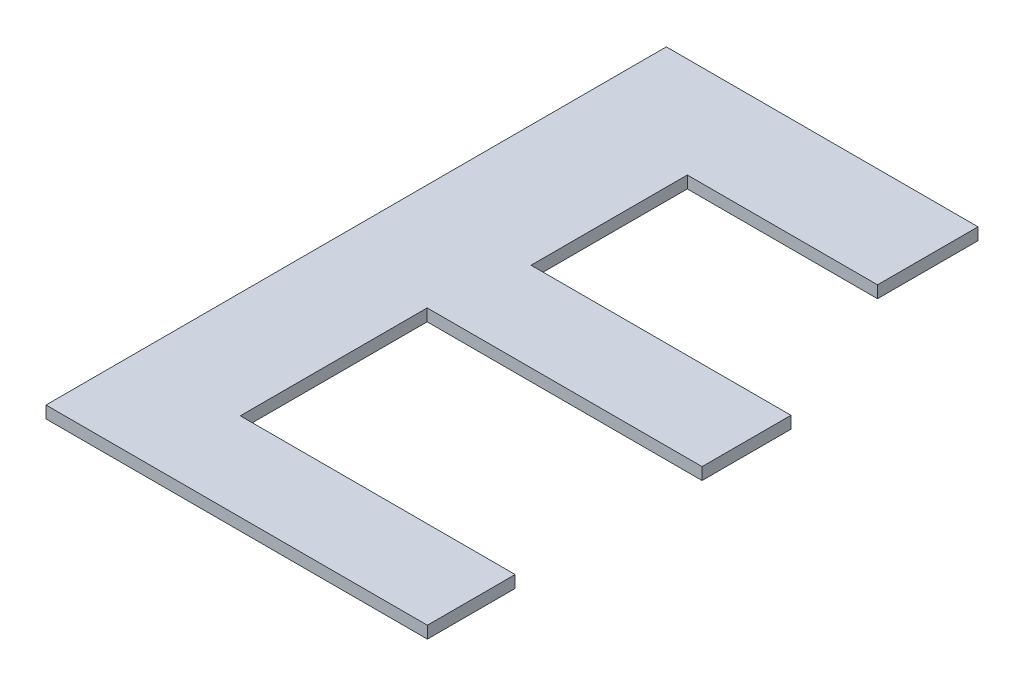
ISO-10303-21;
HEADER;
FILE_DESCRIPTION(('STEP AP214'),'2;1');
FILE_NAME('part.step','',(''),(''),'','','');
FILE_SCHEMA(('AUTOMOTIVE_DESIGN { 1 0 10303 214 1 1 1 1 }'));
ENDSEC;
DATA;
#1=APPLICATION_CONTEXT('core data for automotive mechanical design processes');
#2=APPLICATION_PROTOCOL_DEFINITION('international standard','automotive_design',2000,#1);
#3=PRODUCT_CONTEXT('',#1,'mechanical');
#4=PRODUCT('Part','Part','',(#3));
#5=PRODUCT_RELATED_PRODUCT_CATEGORY('part','',(#4));
#6=PRODUCT_DEFINITION_FORMATION('','',#4);
#7=PRODUCT_DEFINITION_CONTEXT('part definition',#1,'design');
#8=PRODUCT_DEFINITION('design','',#6,#7);
#9=PRODUCT_DEFINITION_SHAPE('','',#8);
#10=(LENGTH_UNIT() NAMED_UNIT(*) SI_UNIT(.MILLI.,.METRE.));
#11=(NAMED_UNIT(*) PLANE_ANGLE_UNIT() SI_UNIT($,.RADIAN.));
#12=(NAMED_UNIT(*) SI_UNIT($,.STERADIAN.) SOLID_ANGLE_UNIT());
#13=UNCERTAINTY_MEASURE_WITH_UNIT(LENGTH_MEASURE(1.E-05),#10,'distance_accuracy_value','');
#14=(GEOMETRIC_REPRESENTATION_CONTEXT(3) GLOBAL_UNCERTAINTY_ASSIGNED_CONTEXT((#13)) GLOBAL_UNIT_ASSIGNED_CONTEXT((#10,
#11,#12)) REPRESENTATION_CONTEXT('',''));
#15=CARTESIAN_POINT('',(0.,0.,0.));
#16=DIRECTION('',(0.,0.,1.));
#17=DIRECTION('',(1.,0.,0.));
#18=AXIS2_PLACEMENT_3D('',#15,#16,#17);
#19=CARTESIAN_POINT('',(-22786.0831141368,6067.85712854681,41050.1414169554));
#20=DIRECTION('',(0.,0.,-1.));
#21=DIRECTION('',(-1.,0.,0.));
#22=AXIS2_PLACEMENT_3D('',#19,#20,#21);
#23=PLANE('',#22);
#24=DIRECTION('',(-1.,0.,0.));
#25=VECTOR('',#24,1.);
#26=CARTESIAN_POINT('',(-22786.0831141368,6087.85712854681,41050.1414169554));
#27=LINE('',#26,#25);
#28=CARTESIAN_POINT('',(-22786.0831141368,6087.85712854681,41050.1414169554));
#29=VERTEX_POINT('',#28);
#30=CARTESIAN_POINT('',(-23417.7710712875,6087.85712854681,41050.1414169554));
#31=VERTEX_POINT('',#30);
#32=EDGE_CURVE('E157',#29,#31,#27,.T.);
#33=ORIENTED_EDGE('',*,*,#32,.T.);
#34=DIRECTION('',(0.,1.,0.));
#35=VECTOR('',#34,1.);
#36=CARTESIAN_POINT('',(-23417.7710712875,6067.85712854681,41050.1414169554));
#37=LINE('',#36,#35);
#38=CARTESIAN_POINT('',(-23417.7710712875,6067.85712854681,41050.1414169554));
#39=VERTEX_POINT('',#38);
#40=EDGE_CURVE('E11',#39,#31,#37,.T.);
#41=ORIENTED_EDGE('',*,*,#40,.F.);
#42=DIRECTION('',(-1.,0.,0.));
#43=VECTOR('',#42,1.);
#44=CARTESIAN_POINT('',(-22786.0831141368,6067.85712854681,41050.1414169554));
#45=LINE('',#44,#43);
#46=CARTESIAN_POINT('',(-22786.0831141368,6067.85712854681,41050.1414169554));
#47=VERTEX_POINT('',#46);
#48=EDGE_CURVE('E179',#47,#39,#45,.T.);
#49=ORIENTED_EDGE('',*,*,#48,.F.);
#50=DIRECTION('',(0.,1.,0.));
#51=VECTOR('',#50,1.);
#52=CARTESIAN_POINT('',(-22786.0831141368,6067.85712854681,41050.1414169554));
#53=LINE('',#52,#51);
#54=EDGE_CURVE('E153',#47,#29,#53,.T.);
#55=ORIENTED_EDGE('',*,*,#54,.T.);
#56=EDGE_LOOP('',(#33,#41,#49,#55));
#57=FACE_BOUND('',#56,.T.);
#58=ADVANCED_FACE('F37',(#57),#23,.F.);
#59=CARTESIAN_POINT('',(-23417.7710712875,6067.85712854681,40022.680514279));
#60=DIRECTION('',(1.,0.,0.));
#61=DIRECTION('',(0.,0.,-1.));
#62=AXIS2_PLACEMENT_3D('',#59,#60,#61);
#63=PLANE('',#62);
#64=DIRECTION('',(0.,0.,-1.));
#65=VECTOR('',#64,1.);
#66=CARTESIAN_POINT('',(-23417.7710712875,6087.85712854681,40022.680514279));
#67=LINE('',#66,#65);
#68=CARTESIAN_POINT('',(-23417.7710712875,6087.85712854681,40022.680514279));
#69=VERTEX_POINT('',#68);
#70=EDGE_CURVE('E160',#31,#69,#67,.T.);
#71=ORIENTED_EDGE('',*,*,#70,.T.);
#72=DIRECTION('',(0.,1.,0.));
#73=VECTOR('',#72,1.);
#74=CARTESIAN_POINT('',(-23417.7710712875,6067.85712854681,40022.680514279));
#75=LINE('',#74,#73);
#76=CARTESIAN_POINT('',(-23417.7710712875,6067.85712854681,40022.680514279));
#77=VERTEX_POINT('',#76);
#78=EDGE_CURVE('E45',#77,#69,#75,.T.);
#79=ORIENTED_EDGE('',*,*,#78,.F.);
#80=DIRECTION('',(0.,0.,-1.));
#81=VECTOR('',#80,1.);
#82=CARTESIAN_POINT('',(-23417.7710712875,6067.85712854681,41050.1414169554));
#83=LINE('',#82,#81);
#84=EDGE_CURVE('E108',#39,#77,#83,.T.);
#85=ORIENTED_EDGE('',*,*,#84,.F.);
#86=ORIENTED_EDGE('',*,*,#40,.T.);
#87=EDGE_LOOP('',(#71,#79,#85,#86));
#88=FACE_BOUND('',#87,.T.);
#89=ADVANCED_FACE('F257',(#88),#63,.F.);
#90=CARTESIAN_POINT('',(-22901.5611417374,6067.85712854681,40022.680514279));
#91=DIRECTION('',(0.,0.,1.));
#92=DIRECTION('',(1.,0.,0.));
#93=AXIS2_PLACEMENT_3D('',#90,#91,#92);
#94=PLANE('',#93);
#95=DIRECTION('',(1.,0.,0.));
#96=VECTOR('',#95,1.);
#97=CARTESIAN_POINT('',(-22901.5611417374,6087.85712854681,40022.680514279));
#98=LINE('',#97,#96);
#99=CARTESIAN_POINT('',(-22901.5611417374,6087.85712854681,40022.680514279));
#100=VERTEX_POINT('',#99);
#101=EDGE_CURVE('E162',#69,#100,#98,.T.);
#102=ORIENTED_EDGE('',*,*,#101,.T.);
#103=DIRECTION('',(0.,1.,0.));
#104=VECTOR('',#103,1.);
#105=CARTESIAN_POINT('',(-22901.5611417374,6067.85712854681,40022.680514279));
#106=LINE('',#105,#104);
#107=CARTESIAN_POINT('',(-22901.5611417374,6067.85712854681,40022.680514279));
#108=VERTEX_POINT('',#107);
#109=EDGE_CURVE('E198',#108,#100,#106,.T.);
#110=ORIENTED_EDGE('',*,*,#109,.F.);
#111=DIRECTION('',(1.,0.,0.));
#112=VECTOR('',#111,1.);
#113=CARTESIAN_POINT('',(-22901.5611417374,6067.85712854681,40022.680514279));
#114=LINE('',#113,#112);
#115=EDGE_CURVE('E206',#77,#108,#114,.T.);
#116=ORIENTED_EDGE('',*,*,#115,.F.);
#117=ORIENTED_EDGE('',*,*,#78,.T.);
#118=EDGE_LOOP('',(#102,#110,#116,#117));
#119=FACE_BOUND('',#118,.T.);
#120=ADVANCED_FACE('F204',(#119),#94,.F.);
#121=CARTESIAN_POINT('',(-22901.5611417374,6067.85712854681,40189.1001960557));
#122=DIRECTION('',(-1.,0.,0.));
#123=DIRECTION('',(0.,0.,1.));
#124=AXIS2_PLACEMENT_3D('',#121,#122,#123);
#125=PLANE('',#124);
#126=DIRECTION('',(0.,0.,1.));
#127=VECTOR('',#126,1.);
#128=CARTESIAN_POINT('',(-22901.5611417374,6087.85712854681,40189.1001960557));
#129=LINE('',#128,#127);
#130=CARTESIAN_POINT('',(-22901.5611417374,6087.85712854681,40189.1001960557));
#131=VERTEX_POINT('',#130);
#132=EDGE_CURVE('E164',#100,#131,#129,.T.);
#133=ORIENTED_EDGE('',*,*,#132,.T.);
#134=DIRECTION('',(0.,1.,0.));
#135=VECTOR('',#134,1.);
#136=CARTESIAN_POINT('',(-22901.5611417374,6067.85712854681,40189.1001960557));
#137=LINE('',#136,#135);
#138=CARTESIAN_POINT('',(-22901.5611417374,6067.85712854681,40189.1001960557));
#139=VERTEX_POINT('',#138);
#140=EDGE_CURVE('E195',#139,#131,#137,.T.);
#141=ORIENTED_EDGE('',*,*,#140,.F.);
#142=DIRECTION('',(0.,0.,1.));
#143=VECTOR('',#142,1.);
#144=CARTESIAN_POINT('',(-22901.5611417374,6067.85712854681,40189.1001960557));
#145=LINE('',#144,#143);
#146=EDGE_CURVE('E224',#108,#139,#145,.T.);
#147=ORIENTED_EDGE('',*,*,#146,.F.);
#148=ORIENTED_EDGE('',*,*,#109,.T.);
#149=EDGE_LOOP('',(#133,#141,#147,#148));
#150=FACE_BOUND('',#149,.T.);
#151=ADVANCED_FACE('F215',(#150),#125,.F.);
#152=CARTESIAN_POINT('',(-23216.6143107564,6067.85712854681,40189.1001960557));
#153=DIRECTION('',(0.,0.,-1.));
#154=DIRECTION('',(-1.,0.,0.));
#155=AXIS2_PLACEMENT_3D('',#152,#153,#154);
#156=PLANE('',#155);
#157=DIRECTION('',(-1.,0.,0.));
#158=VECTOR('',#157,1.);
#159=CARTESIAN_POINT('',(-23216.6143107564,6087.85712854681,40189.1001960557));
#160=LINE('',#159,#158);
#161=CARTESIAN_POINT('',(-23216.6143107564,6087.85712854681,40189.1001960557));
#162=VERTEX_POINT('',#161);
#163=EDGE_CURVE('E166',#131,#162,#160,.T.);
#164=ORIENTED_EDGE('',*,*,#163,.T.);
#165=DIRECTION('',(0.,1.,0.));
#166=VECTOR('',#165,1.);
#167=CARTESIAN_POINT('',(-23216.6143107564,6067.85712854681,40189.1001960557));
#168=LINE('',#167,#166);
#169=CARTESIAN_POINT('',(-23216.6143107564,6067.85712854681,40189.1001960557));
#170=VERTEX_POINT('',#169);
#171=EDGE_CURVE('E192',#170,#162,#168,.T.);
#172=ORIENTED_EDGE('',*,*,#171,.F.);
#173=DIRECTION('',(-1.,0.,0.));
#174=VECTOR('',#173,1.);
#175=CARTESIAN_POINT('',(-23216.6143107564,6067.85712854681,40189.1001960557));
#176=LINE('',#175,#174);
#177=EDGE_CURVE('E221',#139,#170,#176,.T.);
#178=ORIENTED_EDGE('',*,*,#177,.F.);
#179=ORIENTED_EDGE('',*,*,#140,.T.);
#180=EDGE_LOOP('',(#164,#172,#178,#179));
#181=FACE_BOUND('',#180,.T.);
#182=ADVANCED_FACE('F219',(#181),#156,.F.);
#183=CARTESIAN_POINT('',(-23216.6143107564,6067.85712854681,40189.1001960557));
#184=DIRECTION('',(-1.,0.,0.));
#185=DIRECTION('',(0.,0.,1.));
#186=AXIS2_PLACEMENT_3D('',#183,#184,#185);
#187=PLANE('',#186);
#188=DIRECTION('',(0.,0.,1.));
#189=VECTOR('',#188,1.);
#190=CARTESIAN_POINT('',(-23216.6143107564,6087.85712854681,40189.1001960557));
#191=LINE('',#190,#189);
#192=CARTESIAN_POINT('',(-23216.6143107564,6087.85712854681,40447.9247562293));
#193=VERTEX_POINT('',#192);
#194=EDGE_CURVE('E168',#162,#193,#191,.T.);
#195=ORIENTED_EDGE('',*,*,#194,.T.);
#196=DIRECTION('',(0.,1.,0.));
#197=VECTOR('',#196,1.);
#198=CARTESIAN_POINT('',(-23216.6143107564,6067.85712854681,40447.9247562293));
#199=LINE('',#198,#197);
#200=CARTESIAN_POINT('',(-23216.6143107564,6067.85712854681,40447.9247562293));
#201=VERTEX_POINT('',#200);
#202=EDGE_CURVE('E189',#201,#193,#199,.T.);
#203=ORIENTED_EDGE('',*,*,#202,.F.);
#204=DIRECTION('',(0.,0.,1.));
#205=VECTOR('',#204,1.);
#206=CARTESIAN_POINT('',(-23216.6143107564,6067.85712854681,40189.1001960557));
#207=LINE('',#206,#205);
#208=EDGE_CURVE('E223',#170,#201,#207,.T.);
#209=ORIENTED_EDGE('',*,*,#208,.F.);
#210=ORIENTED_EDGE('',*,*,#171,.T.);
#211=EDGE_LOOP('',(#195,#203,#209,#210));
#212=FACE_BOUND('',#211,.T.);
#213=ADVANCED_FACE('F270',(#212),#187,.F.);
#214=CARTESIAN_POINT('',(-23216.6143107564,6067.85712854681,40447.9247562293));
#215=DIRECTION('',(0.,0.,1.));
#216=DIRECTION('',(1.,0.,0.));
#217=AXIS2_PLACEMENT_3D('',#214,#215,#216);
#218=PLANE('',#217);
#219=DIRECTION('',(1.,0.,0.));
#220=VECTOR('',#219,1.);
#221=CARTESIAN_POINT('',(-23216.6143107564,6087.85712854681,40447.9247562293));
#222=LINE('',#221,#220);
#223=CARTESIAN_POINT('',(-22786.0831141368,6087.85712854681,40447.9247562293));
#224=VERTEX_POINT('',#223);
#225=EDGE_CURVE('E170',#193,#224,#222,.T.);
#226=ORIENTED_EDGE('',*,*,#225,.T.);
#227=DIRECTION('',(0.,1.,0.));
#228=VECTOR('',#227,1.);
#229=CARTESIAN_POINT('',(-22786.0831141368,6067.85712854681,40447.9247562293));
#230=LINE('',#229,#228);
#231=CARTESIAN_POINT('',(-22786.0831141368,6067.85712854681,40447.9247562293));
#232=VERTEX_POINT('',#231);
#233=EDGE_CURVE('E186',#232,#224,#230,.T.);
#234=ORIENTED_EDGE('',*,*,#233,.F.);
#235=DIRECTION('',(1.,0.,0.));
#236=VECTOR('',#235,1.);
#237=CARTESIAN_POINT('',(-23216.6143107564,6067.85712854681,40447.9247562293));
#238=LINE('',#237,#236);
#239=EDGE_CURVE('E226',#201,#232,#238,.T.);
#240=ORIENTED_EDGE('',*,*,#239,.F.);
#241=ORIENTED_EDGE('',*,*,#202,.T.);
#242=EDGE_LOOP('',(#226,#234,#240,#241));
#243=FACE_BOUND('',#242,.T.);
#244=ADVANCED_FACE('F273',(#243),#218,.F.);
#245=CARTESIAN_POINT('',(-22786.0831141368,6067.85712854681,40447.9247562293));
#246=DIRECTION('',(-1.,0.,0.));
#247=DIRECTION('',(0.,0.,1.));
#248=AXIS2_PLACEMENT_3D('',#245,#246,#247);
#249=PLANE('',#248);
#250=DIRECTION('',(0.,0.,1.));
#251=VECTOR('',#250,1.);
#252=CARTESIAN_POINT('',(-22786.0831141368,6087.85712854681,40447.9247562293));
#253=LINE('',#252,#251);
#254=CARTESIAN_POINT('',(-22786.0831141368,6087.85712854681,40595.178045331));
#255=VERTEX_POINT('',#254);
#256=EDGE_CURVE('E172',#224,#255,#253,.T.);
#257=ORIENTED_EDGE('',*,*,#256,.T.);
#258=DIRECTION('',(0.,1.,0.));
#259=VECTOR('',#258,1.);
#260=CARTESIAN_POINT('',(-22786.0831141368,6067.85712854681,40595.178045331));
#261=LINE('',#260,#259);
#262=CARTESIAN_POINT('',(-22786.0831141368,6067.85712854681,40595.178045331));
#263=VERTEX_POINT('',#262);
#264=EDGE_CURVE('E183',#263,#255,#261,.T.);
#265=ORIENTED_EDGE('',*,*,#264,.F.);
#266=DIRECTION('',(0.,0.,1.));
#267=VECTOR('',#266,1.);
#268=CARTESIAN_POINT('',(-22786.0831141368,6067.85712854681,40447.9247562293));
#269=LINE('',#268,#267);
#270=EDGE_CURVE('E232',#232,#263,#269,.T.);
#271=ORIENTED_EDGE('',*,*,#270,.F.);
#272=ORIENTED_EDGE('',*,*,#233,.T.);
#273=EDGE_LOOP('',(#257,#265,#271,#272));
#274=FACE_BOUND('',#273,.T.);
#275=ADVANCED_FACE('F238',(#274),#249,.F.);
#276=CARTESIAN_POINT('',(-22786.0831141368,6067.85712854681,40595.178045331));
#277=DIRECTION('',(0.,0.,-1.));
#278=DIRECTION('',(-1.,0.,0.));
#279=AXIS2_PLACEMENT_3D('',#276,#277,#278);
#280=PLANE('',#279);
#281=DIRECTION('',(-1.,0.,0.));
#282=VECTOR('',#281,1.);
#283=CARTESIAN_POINT('',(-22786.0831141368,6087.85712854681,40595.178045331));
#284=LINE('',#283,#282);
#285=CARTESIAN_POINT('',(-23241.381102723,6087.85712854681,40595.178045331));
#286=VERTEX_POINT('',#285);
#287=EDGE_CURVE('E174',#255,#286,#284,.T.);
#288=ORIENTED_EDGE('',*,*,#287,.T.);
#289=DIRECTION('',(0.,1.,0.));
#290=VECTOR('',#289,1.);
#291=CARTESIAN_POINT('',(-23241.381102723,6067.85712854681,40595.178045331));
#292=LINE('',#291,#290);
#293=CARTESIAN_POINT('',(-23241.381102723,6067.85712854681,40595.178045331));
#294=VERTEX_POINT('',#293);
#295=EDGE_CURVE('E148',#294,#286,#292,.T.);
#296=ORIENTED_EDGE('',*,*,#295,.F.);
#297=DIRECTION('',(-1.,0.,0.));
#298=VECTOR('',#297,1.);
#299=CARTESIAN_POINT('',(-22786.0831141368,6067.85712854681,40595.178045331));
#300=LINE('',#299,#298);
#301=EDGE_CURVE('E139',#263,#294,#300,.T.);
#302=ORIENTED_EDGE('',*,*,#301,.F.);
#303=ORIENTED_EDGE('',*,*,#264,.T.);
#304=EDGE_LOOP('',(#288,#296,#302,#303));
#305=FACE_BOUND('',#304,.T.);
#306=ADVANCED_FACE('F242',(#305),#280,.F.);
#307=CARTESIAN_POINT('',(-23241.381102723,6067.85712854681,40595.178045331));
#308=DIRECTION('',(-1.,0.,0.));
#309=DIRECTION('',(0.,0.,1.));
#310=AXIS2_PLACEMENT_3D('',#307,#308,#309);
#311=PLANE('',#310);
#312=DIRECTION('',(0.,0.,1.));
#313=VECTOR('',#312,1.);
#314=CARTESIAN_POINT('',(-23241.381102723,6087.85712854681,40595.178045331));
#315=LINE('',#314,#313);
#316=CARTESIAN_POINT('',(-23241.381102723,6087.85712854681,40904.7371283261));
#317=VERTEX_POINT('',#316);
#318=EDGE_CURVE('E147',#286,#317,#315,.T.);
#319=ORIENTED_EDGE('',*,*,#318,.T.);
#320=DIRECTION('',(0.,1.,0.));
#321=VECTOR('',#320,1.);
#322=CARTESIAN_POINT('',(-23241.381102723,6067.85712854681,40904.7371283261));
#323=LINE('',#322,#321);
#324=CARTESIAN_POINT('',(-23241.381102723,6067.85712854681,40904.7371283261));
#325=VERTEX_POINT('',#324);
#326=EDGE_CURVE('E144',#325,#317,#323,.T.);
#327=ORIENTED_EDGE('',*,*,#326,.F.);
#328=DIRECTION('',(0.,0.,1.));
#329=VECTOR('',#328,1.);
#330=CARTESIAN_POINT('',(-23241.381102723,6067.85712854681,40595.178045331));
#331=LINE('',#330,#329);
#332=EDGE_CURVE('E133',#294,#325,#331,.T.);
#333=ORIENTED_EDGE('',*,*,#332,.F.);
#334=ORIENTED_EDGE('',*,*,#295,.T.);
#335=EDGE_LOOP('',(#319,#327,#333,#334));
#336=FACE_BOUND('',#335,.T.);
#337=ADVANCED_FACE('F145',(#336),#311,.F.);
#338=CARTESIAN_POINT('',(-23241.381102723,6067.85712854681,40904.7371283261));
#339=DIRECTION('',(0.,0.,1.));
#340=DIRECTION('',(1.,0.,0.));
#341=AXIS2_PLACEMENT_3D('',#338,#339,#340);
#342=PLANE('',#341);
#343=DIRECTION('',(1.,0.,0.));
#344=VECTOR('',#343,1.);
#345=CARTESIAN_POINT('',(-23241.381102723,6087.85712854681,40904.7371283261));
#346=LINE('',#345,#344);
#347=CARTESIAN_POINT('',(-22786.0831141368,6087.85712854681,40904.7371283261));
#348=VERTEX_POINT('',#347);
#349=EDGE_CURVE('E94',#317,#348,#346,.T.);
#350=ORIENTED_EDGE('',*,*,#349,.T.);
#351=DIRECTION('',(0.,1.,0.));
#352=VECTOR('',#351,1.);
#353=CARTESIAN_POINT('',(-22786.0831141368,6067.85712854681,40904.7371283261));
#354=LINE('',#353,#352);
#355=CARTESIAN_POINT('',(-22786.0831141368,6067.85712854681,40904.7371283261));
#356=VERTEX_POINT('',#355);
#357=EDGE_CURVE('E149',#356,#348,#354,.T.);
#358=ORIENTED_EDGE('',*,*,#357,.F.);
#359=DIRECTION('',(1.,0.,0.));
#360=VECTOR('',#359,1.);
#361=CARTESIAN_POINT('',(-23241.381102723,6067.85712854681,40904.7371283261));
#362=LINE('',#361,#360);
#363=EDGE_CURVE('E137',#325,#356,#362,.T.);
#364=ORIENTED_EDGE('',*,*,#363,.F.);
#365=ORIENTED_EDGE('',*,*,#326,.T.);
#366=EDGE_LOOP('',(#350,#358,#364,#365));
#367=FACE_BOUND('',#366,.T.);
#368=ADVANCED_FACE('F151',(#367),#342,.F.);
#369=CARTESIAN_POINT('',(-22786.0831141368,6067.85712854681,40904.7371283261));
#370=DIRECTION('',(-1.,0.,0.));
#371=DIRECTION('',(0.,0.,1.));
#372=AXIS2_PLACEMENT_3D('',#369,#370,#371);
#373=PLANE('',#372);
#374=DIRECTION('',(0.,0.,1.));
#375=VECTOR('',#374,1.);
#376=CARTESIAN_POINT('',(-22786.0831141368,6087.85712854681,40904.7371283261));
#377=LINE('',#376,#375);
#378=EDGE_CURVE('E100',#348,#29,#377,.T.);
#379=ORIENTED_EDGE('',*,*,#378,.T.);
#380=ORIENTED_EDGE('',*,*,#54,.F.);
#381=DIRECTION('',(0.,0.,1.));
#382=VECTOR('',#381,1.);
#383=CARTESIAN_POINT('',(-22786.0831141368,6067.85712854681,40904.7371283261));
#384=LINE('',#383,#382);
#385=EDGE_CURVE('E53',#356,#47,#384,.T.);
#386=ORIENTED_EDGE('',*,*,#385,.F.);
#387=ORIENTED_EDGE('',*,*,#357,.T.);
#388=EDGE_LOOP('',(#379,#380,#386,#387));
#389=FACE_BOUND('',#388,.T.);
#390=ADVANCED_FACE('F246',(#389),#373,.F.);
#391=CARTESIAN_POINT('',(0.,6067.85712854681,0.));
#392=DIRECTION('',(0.,-1.,0.));
#393=DIRECTION('',(0.,0.,-1.));
#394=AXIS2_PLACEMENT_3D('',#391,#392,#393);
#395=PLANE('',#394);
#396=ORIENTED_EDGE('',*,*,#48,.T.);
#397=ORIENTED_EDGE('',*,*,#84,.T.);
#398=ORIENTED_EDGE('',*,*,#115,.T.);
#399=ORIENTED_EDGE('',*,*,#146,.T.);
#400=ORIENTED_EDGE('',*,*,#177,.T.);
#401=ORIENTED_EDGE('',*,*,#208,.T.);
#402=ORIENTED_EDGE('',*,*,#239,.T.);
#403=ORIENTED_EDGE('',*,*,#270,.T.);
#404=ORIENTED_EDGE('',*,*,#301,.T.);
#405=ORIENTED_EDGE('',*,*,#332,.T.);
#406=ORIENTED_EDGE('',*,*,#363,.T.);
#407=ORIENTED_EDGE('',*,*,#385,.T.);
#408=EDGE_LOOP('',(#396,#397,#398,#399,#400,#401,#402,#403,#404,#405,#406,#407));
#409=FACE_BOUND('',#408,.T.);
#410=ADVANCED_FACE('F135',(#409),#395,.T.);
#411=CARTESIAN_POINT('',(0.,6087.85712854681,0.));
#412=DIRECTION('',(0.,-1.,0.));
#413=DIRECTION('',(0.,0.,-1.));
#414=AXIS2_PLACEMENT_3D('',#411,#412,#413);
#415=PLANE('',#414);
#416=ORIENTED_EDGE('',*,*,#32,.F.);
#417=ORIENTED_EDGE('',*,*,#378,.F.);
#418=ORIENTED_EDGE('',*,*,#349,.F.);
#419=ORIENTED_EDGE('',*,*,#318,.F.);
#420=ORIENTED_EDGE('',*,*,#287,.F.);
#421=ORIENTED_EDGE('',*,*,#256,.F.);
#422=ORIENTED_EDGE('',*,*,#225,.F.);
#423=ORIENTED_EDGE('',*,*,#194,.F.);
#424=ORIENTED_EDGE('',*,*,#163,.F.);
#425=ORIENTED_EDGE('',*,*,#132,.F.);
#426=ORIENTED_EDGE('',*,*,#101,.F.);
#427=ORIENTED_EDGE('',*,*,#70,.F.);
#428=EDGE_LOOP('',(#416,#417,#418,#419,#420,#421,#422,#423,#424,#425,#426,#427));
#429=FACE_BOUND('',#428,.T.);
#430=ADVANCED_FACE('F210',(#429),#415,.F.);
#431=CLOSED_SHELL('',(#58,#89,#120,#151,#182,#213,#244,#275,#306,#337,#368,#390,#410,#430));
#432=MANIFOLD_SOLID_BREP('B2',#431);
#433=ADVANCED_BREP_SHAPE_REPRESENTATION('',(#18,#432),#14);
#434=SHAPE_DEFINITION_REPRESENTATION(#9,#433);
ENDSEC;
END-ISO-10303-21;
